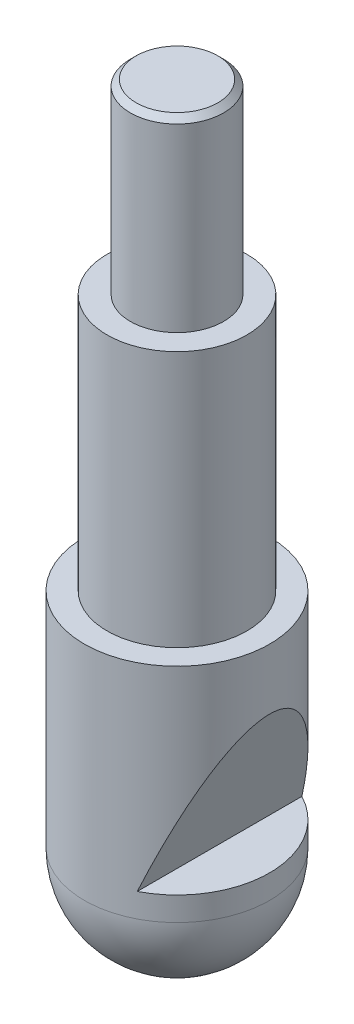
ISO-10303-21;
HEADER;
FILE_DESCRIPTION(('STEP AP214'),'2;1');
FILE_NAME('part.step','',(''),(''),'','','');
FILE_SCHEMA(('AUTOMOTIVE_DESIGN { 1 0 10303 214 1 1 1 1 }'));
ENDSEC;
DATA;
#1=APPLICATION_CONTEXT('core data for automotive mechanical design processes');
#2=APPLICATION_PROTOCOL_DEFINITION('international standard','automotive_design',2000,#1);
#3=PRODUCT_CONTEXT('',#1,'mechanical');
#4=PRODUCT('Part','Part','',(#3));
#5=PRODUCT_RELATED_PRODUCT_CATEGORY('part','',(#4));
#6=PRODUCT_DEFINITION_FORMATION('','',#4);
#7=PRODUCT_DEFINITION_CONTEXT('part definition',#1,'design');
#8=PRODUCT_DEFINITION('design','',#6,#7);
#9=PRODUCT_DEFINITION_SHAPE('','',#8);
#10=(LENGTH_UNIT() NAMED_UNIT(*) SI_UNIT(.MILLI.,.METRE.));
#11=(NAMED_UNIT(*) PLANE_ANGLE_UNIT() SI_UNIT($,.RADIAN.));
#12=(NAMED_UNIT(*) SI_UNIT($,.STERADIAN.) SOLID_ANGLE_UNIT());
#13=UNCERTAINTY_MEASURE_WITH_UNIT(LENGTH_MEASURE(1.E-05),#10,'distance_accuracy_value','');
#14=(GEOMETRIC_REPRESENTATION_CONTEXT(3) GLOBAL_UNCERTAINTY_ASSIGNED_CONTEXT((#13)) GLOBAL_UNIT_ASSIGNED_CONTEXT((#10,
#11,#12)) REPRESENTATION_CONTEXT('',''));
#15=CARTESIAN_POINT('',(0.,0.,0.));
#16=DIRECTION('',(0.,0.,1.));
#17=DIRECTION('',(1.,0.,0.));
#18=AXIS2_PLACEMENT_3D('',#15,#16,#17);
#19=CARTESIAN_POINT('',(0.,7.95,0.));
#20=DIRECTION('',(0.,-1.,0.));
#21=DIRECTION('',(-1.,0.,0.));
#22=AXIS2_PLACEMENT_3D('',#19,#20,#21);
#23=SPHERICAL_SURFACE('',#22,7.95);
#24=CARTESIAN_POINT('',(0.,1.,0.));
#25=DIRECTION('',(0.,1.,0.));
#26=DIRECTION('',(-1.,0.,0.));
#27=AXIS2_PLACEMENT_3D('',#24,#25,#26);
#28=CIRCLE('',#27,3.86005181312376);
#29=CARTESIAN_POINT('',(-3.86005181312375,1.,0.));
#30=VERTEX_POINT('',#29);
#31=EDGE_CURVE('E67',#30,#30,#28,.F.);
#32=ORIENTED_EDGE('',*,*,#31,.F.);
#33=EDGE_LOOP('',(#32));
#34=FACE_BOUND('',#33,.T.);
#35=CARTESIAN_POINT('',(0.,7.95,0.));
#36=DIRECTION('',(0.,-1.,0.));
#37=DIRECTION('',(0.,0.,-1.));
#38=AXIS2_PLACEMENT_3D('',#35,#36,#37);
#39=CIRCLE('',#38,7.95000000000001);
#40=CARTESIAN_POINT('',(0.,7.95,-7.95000000000001));
#41=VERTEX_POINT('',#40);
#42=EDGE_CURVE('E60',#41,#41,#39,.T.);
#43=ORIENTED_EDGE('',*,*,#42,.T.);
#44=EDGE_LOOP('',(#43));
#45=FACE_BOUND('',#44,.T.);
#46=ADVANCED_FACE('F39',(#34,#45),#23,.T.);
#47=CARTESIAN_POINT('',(0.,-9.28144384940847,0.));
#48=DIRECTION('',(0.,-1.,0.));
#49=DIRECTION('',(0.,0.,-1.));
#50=AXIS2_PLACEMENT_3D('',#47,#48,#49);
#51=CYLINDRICAL_SURFACE('',#50,7.95000000000001);
#52=CARTESIAN_POINT('',(0.,10.,0.));
#53=DIRECTION('',(0.,-1.,0.));
#54=DIRECTION('',(0.,0.,-1.));
#55=AXIS2_PLACEMENT_3D('',#52,#53,#54);
#56=CIRCLE('',#55,7.95000000000001);
#57=CARTESIAN_POINT('',(3.64999999999999,10.,7.06257743320384));
#58=VERTEX_POINT('',#57);
#59=CARTESIAN_POINT('',(3.64999999999999,10.,-7.06257743320385));
#60=VERTEX_POINT('',#59);
#61=EDGE_CURVE('E59',#58,#60,#56,.F.);
#62=ORIENTED_EDGE('',*,*,#61,.F.);
#63=CARTESIAN_POINT('',(0.,-0.0162790697673665,0.));
#64=DIRECTION('',(-0.939560727813927,0.342382299118636,0.));
#65=DIRECTION('',(-0.342382299118636,-0.939560727813927,0.));
#66=AXIS2_PLACEMENT_3D('',#63,#64,#65);
#67=ELLIPSE('',#66,23.2196583189755,7.95000000000001);
#68=EDGE_CURVE('E52',#60,#58,#67,.F.);
#69=ORIENTED_EDGE('',*,*,#68,.F.);
#70=EDGE_LOOP('',(#62,#69));
#71=FACE_BOUND('',#70,.T.);
#72=CARTESIAN_POINT('',(0.,27.,0.));
#73=DIRECTION('',(0.,-1.,0.));
#74=DIRECTION('',(0.,0.,-1.));
#75=AXIS2_PLACEMENT_3D('',#72,#73,#74);
#76=CIRCLE('',#75,7.95000000000001);
#77=CARTESIAN_POINT('',(0.,27.,-7.95000000000001));
#78=VERTEX_POINT('',#77);
#79=EDGE_CURVE('E81',#78,#78,#76,.T.);
#80=ORIENTED_EDGE('',*,*,#79,.T.);
#81=EDGE_LOOP('',(#80));
#82=FACE_BOUND('',#81,.T.);
#83=ORIENTED_EDGE('',*,*,#42,.F.);
#84=EDGE_LOOP('',(#83));
#85=FACE_BOUND('',#84,.T.);
#86=ADVANCED_FACE('F57',(#71,#82,#85),#51,.T.);
#87=CARTESIAN_POINT('',(6.00000000000001,27.,0.));
#88=DIRECTION('',(0.,1.,0.));
#89=DIRECTION('',(0.,0.,1.));
#90=AXIS2_PLACEMENT_3D('',#87,#88,#89);
#91=PLANE('',#90);
#92=CARTESIAN_POINT('',(0.,27.,0.));
#93=DIRECTION('',(0.,-1.,0.));
#94=DIRECTION('',(0.,0.,-1.));
#95=AXIS2_PLACEMENT_3D('',#92,#93,#94);
#96=CIRCLE('',#95,6.00000000000001);
#97=CARTESIAN_POINT('',(0.,27.,-6.00000000000001));
#98=VERTEX_POINT('',#97);
#99=EDGE_CURVE('E78',#98,#98,#96,.T.);
#100=ORIENTED_EDGE('',*,*,#99,.T.);
#101=EDGE_LOOP('',(#100));
#102=FACE_BOUND('',#101,.T.);
#103=ORIENTED_EDGE('',*,*,#79,.F.);
#104=EDGE_LOOP('',(#103));
#105=FACE_BOUND('',#104,.T.);
#106=ADVANCED_FACE('F108',(#102,#105),#91,.T.);
#107=CARTESIAN_POINT('',(0.,-9.28144384940847,0.));
#108=DIRECTION('',(0.,-1.,0.));
#109=DIRECTION('',(0.,0.,-1.));
#110=AXIS2_PLACEMENT_3D('',#107,#108,#109);
#111=CYLINDRICAL_SURFACE('',#110,6.);
#112=CARTESIAN_POINT('',(0.,49.,0.));
#113=DIRECTION('',(0.,-1.,0.));
#114=DIRECTION('',(0.,0.,-1.));
#115=AXIS2_PLACEMENT_3D('',#112,#113,#114);
#116=CIRCLE('',#115,6.);
#117=CARTESIAN_POINT('',(0.,49.,-6.));
#118=VERTEX_POINT('',#117);
#119=EDGE_CURVE('E75',#118,#118,#116,.T.);
#120=ORIENTED_EDGE('',*,*,#119,.T.);
#121=EDGE_LOOP('',(#120));
#122=FACE_BOUND('',#121,.T.);
#123=ORIENTED_EDGE('',*,*,#99,.F.);
#124=EDGE_LOOP('',(#123));
#125=FACE_BOUND('',#124,.T.);
#126=ADVANCED_FACE('F116',(#122,#125),#111,.T.);
#127=CARTESIAN_POINT('',(4.,49.,0.));
#128=DIRECTION('',(0.,1.,0.));
#129=DIRECTION('',(0.,0.,1.));
#130=AXIS2_PLACEMENT_3D('',#127,#128,#129);
#131=PLANE('',#130);
#132=CARTESIAN_POINT('',(0.,49.,0.));
#133=DIRECTION('',(0.,-1.,0.));
#134=DIRECTION('',(0.,0.,-1.));
#135=AXIS2_PLACEMENT_3D('',#132,#133,#134);
#136=CIRCLE('',#135,4.);
#137=CARTESIAN_POINT('',(0.,49.,-4.));
#138=VERTEX_POINT('',#137);
#139=EDGE_CURVE('E70',#138,#138,#136,.T.);
#140=ORIENTED_EDGE('',*,*,#139,.T.);
#141=EDGE_LOOP('',(#140));
#142=FACE_BOUND('',#141,.T.);
#143=ORIENTED_EDGE('',*,*,#119,.F.);
#144=EDGE_LOOP('',(#143));
#145=FACE_BOUND('',#144,.T.);
#146=ADVANCED_FACE('F122',(#142,#145),#131,.T.);
#147=CARTESIAN_POINT('',(0.,-9.28144384940847,0.));
#148=DIRECTION('',(0.,-1.,0.));
#149=DIRECTION('',(0.,0.,-1.));
#150=AXIS2_PLACEMENT_3D('',#147,#148,#149);
#151=CYLINDRICAL_SURFACE('',#150,4.);
#152=CARTESIAN_POINT('',(0.,64.5,0.));
#153=DIRECTION('',(0.,1.,0.));
#154=DIRECTION('',(0.,0.,1.));
#155=AXIS2_PLACEMENT_3D('',#152,#153,#154);
#156=CIRCLE('',#155,4.);
#157=CARTESIAN_POINT('',(0.,64.5,4.));
#158=VERTEX_POINT('',#157);
#159=EDGE_CURVE('E46',#158,#158,#156,.F.);
#160=ORIENTED_EDGE('',*,*,#159,.T.);
#161=EDGE_LOOP('',(#160));
#162=FACE_BOUND('',#161,.T.);
#163=ORIENTED_EDGE('',*,*,#139,.F.);
#164=EDGE_LOOP('',(#163));
#165=FACE_BOUND('',#164,.T.);
#166=ADVANCED_FACE('F88',(#162,#165),#151,.T.);
#167=CARTESIAN_POINT('',(0.,65.,0.));
#168=DIRECTION('',(0.,1.,0.));
#169=DIRECTION('',(0.,0.,1.));
#170=AXIS2_PLACEMENT_3D('',#167,#168,#169);
#171=PLANE('',#170);
#172=CARTESIAN_POINT('',(0.,65.,0.));
#173=DIRECTION('',(0.,1.,0.));
#174=DIRECTION('',(0.,0.,1.));
#175=AXIS2_PLACEMENT_3D('',#172,#173,#174);
#176=CIRCLE('',#175,3.49999999999999);
#177=CARTESIAN_POINT('',(0.,65.,3.49999999999999));
#178=VERTEX_POINT('',#177);
#179=EDGE_CURVE('E13',#178,#178,#176,.T.);
#180=ORIENTED_EDGE('',*,*,#179,.T.);
#181=EDGE_LOOP('',(#180));
#182=FACE_BOUND('',#181,.T.);
#183=ADVANCED_FACE('F128',(#182),#171,.T.);
#184=CARTESIAN_POINT('',(3.64999999999999,10.,-7.95000000000001));
#185=DIRECTION('',(-0.939560727813927,0.342382299118636,0.));
#186=DIRECTION('',(-0.342382299118636,-0.939560727813927,0.));
#187=AXIS2_PLACEMENT_3D('',#184,#185,#186);
#188=PLANE('',#187);
#189=DIRECTION('',(0.,0.,1.));
#190=VECTOR('',#189,1.);
#191=CARTESIAN_POINT('',(3.64999999999999,10.,-7.95000000000001));
#192=LINE('',#191,#190);
#193=EDGE_CURVE('E64',#60,#58,#192,.T.);
#194=ORIENTED_EDGE('',*,*,#193,.F.);
#195=ORIENTED_EDGE('',*,*,#68,.T.);
#196=EDGE_LOOP('',(#194,#195));
#197=FACE_BOUND('',#196,.T.);
#198=ADVANCED_FACE('F66',(#197),#188,.F.);
#199=CARTESIAN_POINT('',(14.6175381978426,10.,-7.95000000000001));
#200=DIRECTION('',(0.,-1.,0.));
#201=DIRECTION('',(0.,0.,-1.));
#202=AXIS2_PLACEMENT_3D('',#199,#200,#201);
#203=PLANE('',#202);
#204=ORIENTED_EDGE('',*,*,#61,.T.);
#205=ORIENTED_EDGE('',*,*,#193,.T.);
#206=EDGE_LOOP('',(#204,#205));
#207=FACE_BOUND('',#206,.T.);
#208=ADVANCED_FACE('F63',(#207),#203,.F.);
#209=CARTESIAN_POINT('',(14.6175381978426,1.,-7.95000000000001));
#210=DIRECTION('',(0.,1.,0.));
#211=DIRECTION('',(-1.,0.,0.));
#212=AXIS2_PLACEMENT_3D('',#209,#210,#211);
#213=PLANE('',#212);
#214=ORIENTED_EDGE('',*,*,#31,.T.);
#215=EDGE_LOOP('',(#214));
#216=FACE_BOUND('',#215,.T.);
#217=ADVANCED_FACE('F93',(#216),#213,.F.);
#218=CARTESIAN_POINT('',(0.,64.5,0.));
#219=DIRECTION('',(0.,-1.,0.));
#220=DIRECTION('',(0.,0.,-1.));
#221=AXIS2_PLACEMENT_3D('',#218,#219,#220);
#222=CONICAL_SURFACE('',#221,4.,0.78539816339745);
#223=ORIENTED_EDGE('',*,*,#179,.F.);
#224=EDGE_LOOP('',(#223));
#225=FACE_BOUND('',#224,.T.);
#226=ORIENTED_EDGE('',*,*,#159,.F.);
#227=EDGE_LOOP('',(#226));
#228=FACE_BOUND('',#227,.T.);
#229=ADVANCED_FACE('F91',(#225,#228),#222,.T.);
#230=CLOSED_SHELL('',(#46,#86,#106,#126,#146,#166,#183,#198,#208,#217,#229));
#231=MANIFOLD_SOLID_BREP('B2',#230);
#232=ADVANCED_BREP_SHAPE_REPRESENTATION('',(#18,#231),#14);
#233=SHAPE_DEFINITION_REPRESENTATION(#9,#232);
ENDSEC;
END-ISO-10303-21;
